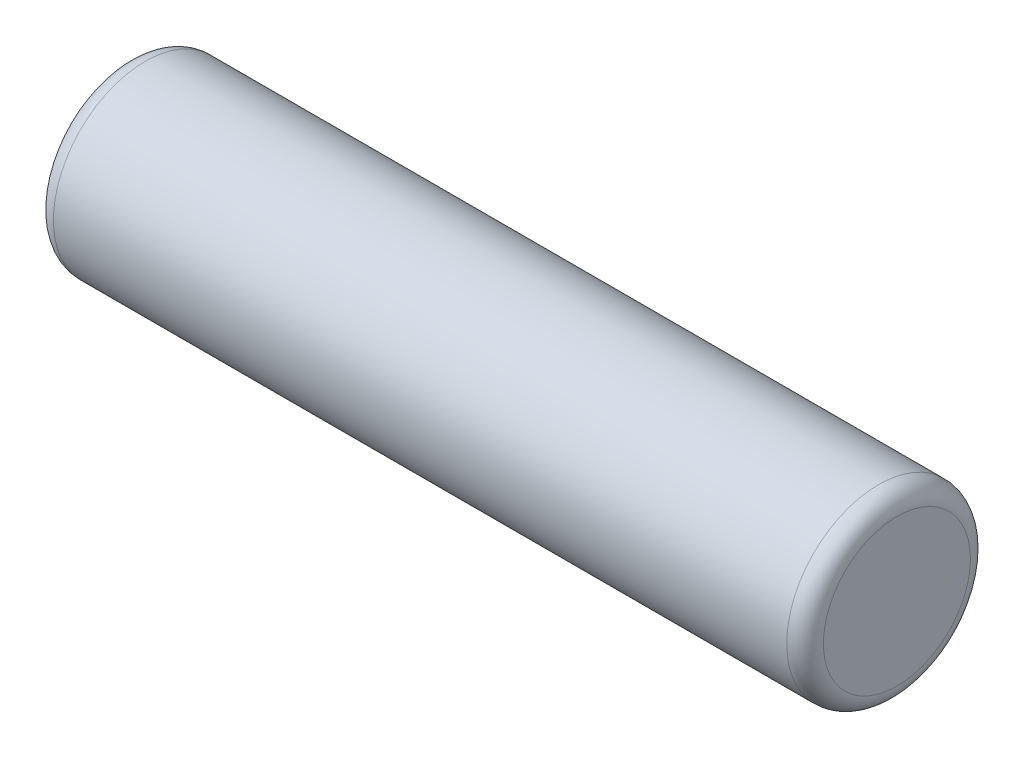
ISO-10303-21;
HEADER;
FILE_DESCRIPTION(('STEP AP214'),'2;1');
FILE_NAME('part.step','',(''),(''),'','','');
FILE_SCHEMA(('AUTOMOTIVE_DESIGN { 1 0 10303 214 1 1 1 1 }'));
ENDSEC;
DATA;
#1=APPLICATION_CONTEXT('core data for automotive mechanical design processes');
#2=APPLICATION_PROTOCOL_DEFINITION('international standard','automotive_design',2000,#1);
#3=PRODUCT_CONTEXT('',#1,'mechanical');
#4=PRODUCT('Part','Part','',(#3));
#5=PRODUCT_RELATED_PRODUCT_CATEGORY('part','',(#4));
#6=PRODUCT_DEFINITION_FORMATION('','',#4);
#7=PRODUCT_DEFINITION_CONTEXT('part definition',#1,'design');
#8=PRODUCT_DEFINITION('design','',#6,#7);
#9=PRODUCT_DEFINITION_SHAPE('','',#8);
#10=(LENGTH_UNIT() NAMED_UNIT(*) SI_UNIT(.MILLI.,.METRE.));
#11=(NAMED_UNIT(*) PLANE_ANGLE_UNIT() SI_UNIT($,.RADIAN.));
#12=(NAMED_UNIT(*) SI_UNIT($,.STERADIAN.) SOLID_ANGLE_UNIT());
#13=UNCERTAINTY_MEASURE_WITH_UNIT(LENGTH_MEASURE(1.E-05),#10,'distance_accuracy_value','');
#14=(GEOMETRIC_REPRESENTATION_CONTEXT(3) GLOBAL_UNCERTAINTY_ASSIGNED_CONTEXT((#13)) GLOBAL_UNIT_ASSIGNED_CONTEXT((#10,
#11,#12)) REPRESENTATION_CONTEXT('',''));
#15=CARTESIAN_POINT('',(0.,0.,0.));
#16=DIRECTION('',(0.,0.,1.));
#17=DIRECTION('',(1.,0.,0.));
#18=AXIS2_PLACEMENT_3D('',#15,#16,#17);
#19=CARTESIAN_POINT('',(0.,0.,0.));
#20=DIRECTION('',(1.,0.,0.));
#21=DIRECTION('',(0.,0.,-1.));
#22=AXIS2_PLACEMENT_3D('',#19,#20,#21);
#23=PLANE('',#22);
#24=CARTESIAN_POINT('',(0.,0.,0.));
#25=DIRECTION('',(1.,0.,0.));
#26=DIRECTION('',(0.,0.,-1.));
#27=AXIS2_PLACEMENT_3D('',#24,#25,#26);
#28=CIRCLE('',#27,1.68000000000008);
#29=CARTESIAN_POINT('',(0.,0.,-1.68000000000008));
#30=VERTEX_POINT('',#29);
#31=EDGE_CURVE('E30',#30,#30,#28,.T.);
#32=ORIENTED_EDGE('',*,*,#31,.F.);
#33=EDGE_LOOP('',(#32));
#34=FACE_BOUND('',#33,.T.);
#35=ADVANCED_FACE('F15',(#34),#23,.F.);
#36=CARTESIAN_POINT('',(0.419999999999915,0.,0.));
#37=DIRECTION('',(1.,0.,0.));
#38=DIRECTION('',(0.,0.,-1.));
#39=AXIS2_PLACEMENT_3D('',#36,#37,#38);
#40=TOROIDAL_SURFACE('',#39,1.68000000000008,0.419999999999915);
#41=ORIENTED_EDGE('',*,*,#31,.T.);
#42=EDGE_LOOP('',(#41));
#43=FACE_BOUND('',#42,.T.);
#44=CARTESIAN_POINT('',(0.420000000000002,0.,0.));
#45=DIRECTION('',(1.,0.,0.));
#46=DIRECTION('',(0.,0.,-1.));
#47=AXIS2_PLACEMENT_3D('',#44,#45,#46);
#48=CIRCLE('',#47,2.1);
#49=CARTESIAN_POINT('',(0.420000000000002,0.,-2.1));
#50=VERTEX_POINT('',#49);
#51=EDGE_CURVE('E26',#50,#50,#48,.T.);
#52=ORIENTED_EDGE('',*,*,#51,.F.);
#53=EDGE_LOOP('',(#52));
#54=FACE_BOUND('',#53,.T.);
#55=ADVANCED_FACE('F36',(#43,#54),#40,.T.);
#56=CARTESIAN_POINT('',(17.6,0.,0.));
#57=DIRECTION('',(1.,0.,0.));
#58=DIRECTION('',(0.,0.,-1.));
#59=AXIS2_PLACEMENT_3D('',#56,#57,#58);
#60=CYLINDRICAL_SURFACE('',#59,2.1);
#61=CARTESIAN_POINT('',(17.18,0.,0.));
#62=DIRECTION('',(1.,0.,0.));
#63=DIRECTION('',(0.,0.,-1.));
#64=AXIS2_PLACEMENT_3D('',#61,#62,#63);
#65=CIRCLE('',#64,2.1);
#66=CARTESIAN_POINT('',(17.18,0.,-2.1));
#67=VERTEX_POINT('',#66);
#68=EDGE_CURVE('E22',#67,#67,#65,.T.);
#69=ORIENTED_EDGE('',*,*,#68,.F.);
#70=EDGE_LOOP('',(#69));
#71=FACE_BOUND('',#70,.T.);
#72=ORIENTED_EDGE('',*,*,#51,.T.);
#73=EDGE_LOOP('',(#72));
#74=FACE_BOUND('',#73,.T.);
#75=ADVANCED_FACE('F45',(#71,#74),#60,.T.);
#76=CARTESIAN_POINT('',(17.1799999999995,0.,0.));
#77=DIRECTION('',(1.,0.,0.));
#78=DIRECTION('',(0.,0.,-1.));
#79=AXIS2_PLACEMENT_3D('',#76,#77,#78);
#80=TOROIDAL_SURFACE('',#79,1.67999999999949,0.420000000000516);
#81=ORIENTED_EDGE('',*,*,#68,.T.);
#82=EDGE_LOOP('',(#81));
#83=FACE_BOUND('',#82,.T.);
#84=CARTESIAN_POINT('',(17.6,0.,0.));
#85=DIRECTION('',(1.,0.,0.));
#86=DIRECTION('',(0.,0.,-1.));
#87=AXIS2_PLACEMENT_3D('',#84,#85,#86);
#88=CIRCLE('',#87,1.68000011923969);
#89=CARTESIAN_POINT('',(17.6,0.,-1.68000011923969));
#90=VERTEX_POINT('',#89);
#91=EDGE_CURVE('E10',#90,#90,#88,.T.);
#92=ORIENTED_EDGE('',*,*,#91,.F.);
#93=EDGE_LOOP('',(#92));
#94=FACE_BOUND('',#93,.T.);
#95=ADVANCED_FACE('F49',(#83,#94),#80,.T.);
#96=CARTESIAN_POINT('',(17.6,1.68,0.));
#97=DIRECTION('',(-1.,0.,0.));
#98=DIRECTION('',(0.,0.,1.));
#99=AXIS2_PLACEMENT_3D('',#96,#97,#98);
#100=PLANE('',#99);
#101=ORIENTED_EDGE('',*,*,#91,.T.);
#102=EDGE_LOOP('',(#101));
#103=FACE_BOUND('',#102,.T.);
#104=ADVANCED_FACE('F17',(#103),#100,.F.);
#105=CLOSED_SHELL('',(#35,#55,#75,#95,#104));
#106=MANIFOLD_SOLID_BREP('B1',#105);
#107=ADVANCED_BREP_SHAPE_REPRESENTATION('',(#18,#106),#14);
#108=SHAPE_DEFINITION_REPRESENTATION(#9,#107);
ENDSEC;
END-ISO-10303-21;
